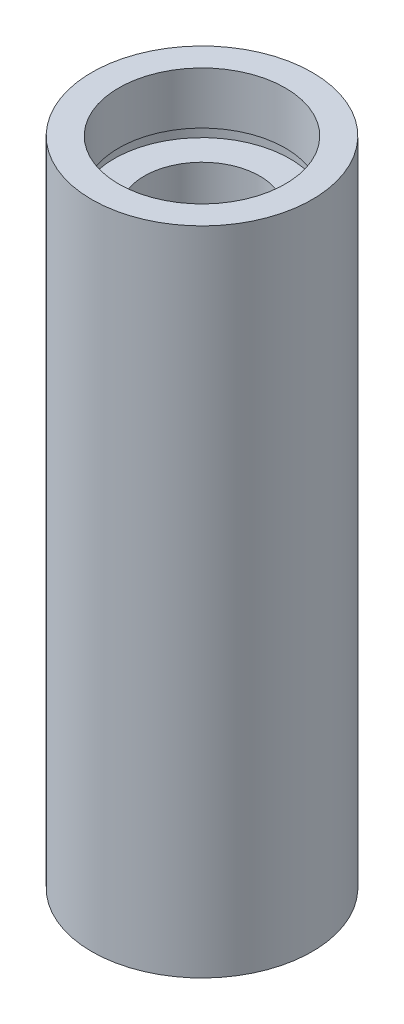
ISO-10303-21;
HEADER;
FILE_DESCRIPTION(('STEP AP214'),'2;1');
FILE_NAME('part.step','',(''),(''),'','','');
FILE_SCHEMA(('AUTOMOTIVE_DESIGN { 1 0 10303 214 1 1 1 1 }'));
ENDSEC;
DATA;
#1=APPLICATION_CONTEXT('core data for automotive mechanical design processes');
#2=APPLICATION_PROTOCOL_DEFINITION('international standard','automotive_design',2000,#1);
#3=PRODUCT_CONTEXT('',#1,'mechanical');
#4=PRODUCT('Part','Part','',(#3));
#5=PRODUCT_RELATED_PRODUCT_CATEGORY('part','',(#4));
#6=PRODUCT_DEFINITION_FORMATION('','',#4);
#7=PRODUCT_DEFINITION_CONTEXT('part definition',#1,'design');
#8=PRODUCT_DEFINITION('design','',#6,#7);
#9=PRODUCT_DEFINITION_SHAPE('','',#8);
#10=(LENGTH_UNIT() NAMED_UNIT(*) SI_UNIT(.MILLI.,.METRE.));
#11=(NAMED_UNIT(*) PLANE_ANGLE_UNIT() SI_UNIT($,.RADIAN.));
#12=(NAMED_UNIT(*) SI_UNIT($,.STERADIAN.) SOLID_ANGLE_UNIT());
#13=UNCERTAINTY_MEASURE_WITH_UNIT(LENGTH_MEASURE(1.E-05),#10,'distance_accuracy_value','');
#14=(GEOMETRIC_REPRESENTATION_CONTEXT(3) GLOBAL_UNCERTAINTY_ASSIGNED_CONTEXT((#13)) GLOBAL_UNIT_ASSIGNED_CONTEXT((#10,
#11,#12)) REPRESENTATION_CONTEXT('',''));
#15=CARTESIAN_POINT('',(0.,0.,0.));
#16=DIRECTION('',(0.,0.,1.));
#17=DIRECTION('',(1.,0.,0.));
#18=AXIS2_PLACEMENT_3D('',#15,#16,#17);
#19=CARTESIAN_POINT('',(7.00000000000002,0.,0.));
#20=DIRECTION('',(0.,1.,0.));
#21=DIRECTION('',(0.,0.,1.));
#22=AXIS2_PLACEMENT_3D('',#19,#20,#21);
#23=PLANE('',#22);
#24=CARTESIAN_POINT('',(0.,0.,0.));
#25=DIRECTION('',(0.,1.,0.));
#26=DIRECTION('',(0.,0.,1.));
#27=AXIS2_PLACEMENT_3D('',#24,#25,#26);
#28=CIRCLE('',#27,9.52500000000002);
#29=CARTESIAN_POINT('',(0.,0.,9.52500000000002));
#30=VERTEX_POINT('',#29);
#31=EDGE_CURVE('E10',#30,#30,#28,.T.);
#32=ORIENTED_EDGE('',*,*,#31,.F.);
#33=EDGE_LOOP('',(#32));
#34=FACE_BOUND('',#33,.T.);
#35=CARTESIAN_POINT('',(0.,0.,0.));
#36=DIRECTION('',(0.,1.,0.));
#37=DIRECTION('',(0.,0.,1.));
#38=AXIS2_PLACEMENT_3D('',#35,#36,#37);
#39=CIRCLE('',#38,7.00000000000002);
#40=CARTESIAN_POINT('',(0.,0.,7.00000000000002));
#41=VERTEX_POINT('',#40);
#42=EDGE_CURVE('E77',#41,#41,#39,.T.);
#43=ORIENTED_EDGE('',*,*,#42,.T.);
#44=EDGE_LOOP('',(#43));
#45=FACE_BOUND('',#44,.T.);
#46=ADVANCED_FACE('F37',(#34,#45),#23,.F.);
#47=CARTESIAN_POINT('',(0.,161.376166943427,0.));
#48=DIRECTION('',(0.,1.,0.));
#49=DIRECTION('',(0.,0.,1.));
#50=AXIS2_PLACEMENT_3D('',#47,#48,#49);
#51=CYLINDRICAL_SURFACE('',#50,9.52500000000002);
#52=CARTESIAN_POINT('',(0.,56.3,0.));
#53=DIRECTION('',(0.,1.,0.));
#54=DIRECTION('',(0.,0.,1.));
#55=AXIS2_PLACEMENT_3D('',#52,#53,#54);
#56=CIRCLE('',#55,9.52500000000002);
#57=CARTESIAN_POINT('',(0.,56.3,9.52500000000002));
#58=VERTEX_POINT('',#57);
#59=EDGE_CURVE('E43',#58,#58,#56,.T.);
#60=ORIENTED_EDGE('',*,*,#59,.F.);
#61=EDGE_LOOP('',(#60));
#62=FACE_BOUND('',#61,.T.);
#63=ORIENTED_EDGE('',*,*,#31,.T.);
#64=EDGE_LOOP('',(#63));
#65=FACE_BOUND('',#64,.T.);
#66=ADVANCED_FACE('F138',(#62,#65),#51,.T.);
#67=CARTESIAN_POINT('',(7.20000000000001,56.3,0.));
#68=DIRECTION('',(0.,-1.,0.));
#69=DIRECTION('',(0.,0.,-1.));
#70=AXIS2_PLACEMENT_3D('',#67,#68,#69);
#71=PLANE('',#70);
#72=CARTESIAN_POINT('',(0.,56.3,0.));
#73=DIRECTION('',(0.,1.,0.));
#74=DIRECTION('',(0.,0.,1.));
#75=AXIS2_PLACEMENT_3D('',#72,#73,#74);
#76=CIRCLE('',#75,7.20000000000001);
#77=CARTESIAN_POINT('',(0.,56.3,7.20000000000001));
#78=VERTEX_POINT('',#77);
#79=EDGE_CURVE('E47',#78,#78,#76,.T.);
#80=ORIENTED_EDGE('',*,*,#79,.F.);
#81=EDGE_LOOP('',(#80));
#82=FACE_BOUND('',#81,.T.);
#83=ORIENTED_EDGE('',*,*,#59,.T.);
#84=EDGE_LOOP('',(#83));
#85=FACE_BOUND('',#84,.T.);
#86=ADVANCED_FACE('F133',(#82,#85),#71,.F.);
#87=CARTESIAN_POINT('',(0.,161.376166943427,0.));
#88=DIRECTION('',(0.,1.,0.));
#89=DIRECTION('',(0.,0.,1.));
#90=AXIS2_PLACEMENT_3D('',#87,#88,#89);
#91=CYLINDRICAL_SURFACE('',#90,7.20000000000001);
#92=CARTESIAN_POINT('',(0.,51.8,0.));
#93=DIRECTION('',(0.,1.,0.));
#94=DIRECTION('',(0.,0.,1.));
#95=AXIS2_PLACEMENT_3D('',#92,#93,#94);
#96=CIRCLE('',#95,7.20000000000001);
#97=CARTESIAN_POINT('',(0.,51.8,7.20000000000001));
#98=VERTEX_POINT('',#97);
#99=EDGE_CURVE('E51',#98,#98,#96,.T.);
#100=ORIENTED_EDGE('',*,*,#99,.F.);
#101=EDGE_LOOP('',(#100));
#102=FACE_BOUND('',#101,.T.);
#103=ORIENTED_EDGE('',*,*,#79,.T.);
#104=EDGE_LOOP('',(#103));
#105=FACE_BOUND('',#104,.T.);
#106=ADVANCED_FACE('F127',(#102,#105),#91,.F.);
#107=CARTESIAN_POINT('',(7.20000000000001,51.8,0.));
#108=DIRECTION('',(0.,1.,0.));
#109=DIRECTION('',(0.,0.,1.));
#110=AXIS2_PLACEMENT_3D('',#107,#108,#109);
#111=PLANE('',#110);
#112=CARTESIAN_POINT('',(0.,51.8,0.));
#113=DIRECTION('',(0.,1.,0.));
#114=DIRECTION('',(0.,0.,1.));
#115=AXIS2_PLACEMENT_3D('',#112,#113,#114);
#116=CIRCLE('',#115,7.60000000000002);
#117=CARTESIAN_POINT('',(0.,51.8,7.60000000000002));
#118=VERTEX_POINT('',#117);
#119=EDGE_CURVE('E56',#118,#118,#116,.T.);
#120=ORIENTED_EDGE('',*,*,#119,.F.);
#121=EDGE_LOOP('',(#120));
#122=FACE_BOUND('',#121,.T.);
#123=ORIENTED_EDGE('',*,*,#99,.T.);
#124=EDGE_LOOP('',(#123));
#125=FACE_BOUND('',#124,.T.);
#126=ADVANCED_FACE('F121',(#122,#125),#111,.F.);
#127=CARTESIAN_POINT('',(0.,161.376166943427,0.));
#128=DIRECTION('',(0.,1.,0.));
#129=DIRECTION('',(0.,0.,1.));
#130=AXIS2_PLACEMENT_3D('',#127,#128,#129);
#131=CYLINDRICAL_SURFACE('',#130,7.60000000000002);
#132=CARTESIAN_POINT('',(0.,50.8,0.));
#133=DIRECTION('',(0.,1.,0.));
#134=DIRECTION('',(0.,0.,1.));
#135=AXIS2_PLACEMENT_3D('',#132,#133,#134);
#136=CIRCLE('',#135,7.60000000000002);
#137=CARTESIAN_POINT('',(0.,50.8,7.60000000000002));
#138=VERTEX_POINT('',#137);
#139=EDGE_CURVE('E59',#138,#138,#136,.T.);
#140=ORIENTED_EDGE('',*,*,#139,.F.);
#141=EDGE_LOOP('',(#140));
#142=FACE_BOUND('',#141,.T.);
#143=ORIENTED_EDGE('',*,*,#119,.T.);
#144=EDGE_LOOP('',(#143));
#145=FACE_BOUND('',#144,.T.);
#146=ADVANCED_FACE('F115',(#142,#145),#131,.F.);
#147=CARTESIAN_POINT('',(5.00000000000002,50.8,0.));
#148=DIRECTION('',(0.,-1.,0.));
#149=DIRECTION('',(0.,0.,-1.));
#150=AXIS2_PLACEMENT_3D('',#147,#148,#149);
#151=PLANE('',#150);
#152=CARTESIAN_POINT('',(0.,50.8,0.));
#153=DIRECTION('',(0.,1.,0.));
#154=DIRECTION('',(0.,0.,1.));
#155=AXIS2_PLACEMENT_3D('',#152,#153,#154);
#156=CIRCLE('',#155,5.00000000000002);
#157=CARTESIAN_POINT('',(0.,50.8,5.00000000000002));
#158=VERTEX_POINT('',#157);
#159=EDGE_CURVE('E62',#158,#158,#156,.T.);
#160=ORIENTED_EDGE('',*,*,#159,.F.);
#161=EDGE_LOOP('',(#160));
#162=FACE_BOUND('',#161,.T.);
#163=ORIENTED_EDGE('',*,*,#139,.T.);
#164=EDGE_LOOP('',(#163));
#165=FACE_BOUND('',#164,.T.);
#166=ADVANCED_FACE('F109',(#162,#165),#151,.F.);
#167=CARTESIAN_POINT('',(0.,161.376166943427,0.));
#168=DIRECTION('',(0.,1.,0.));
#169=DIRECTION('',(0.,0.,1.));
#170=AXIS2_PLACEMENT_3D('',#167,#168,#169);
#171=CYLINDRICAL_SURFACE('',#170,5.00000000000002);
#172=CARTESIAN_POINT('',(0.,5.49999999999998,0.));
#173=DIRECTION('',(0.,1.,0.));
#174=DIRECTION('',(0.,0.,1.));
#175=AXIS2_PLACEMENT_3D('',#172,#173,#174);
#176=CIRCLE('',#175,5.00000000000002);
#177=CARTESIAN_POINT('',(0.,5.49999999999998,5.00000000000002));
#178=VERTEX_POINT('',#177);
#179=EDGE_CURVE('E65',#178,#178,#176,.T.);
#180=ORIENTED_EDGE('',*,*,#179,.F.);
#181=EDGE_LOOP('',(#180));
#182=FACE_BOUND('',#181,.T.);
#183=ORIENTED_EDGE('',*,*,#159,.T.);
#184=EDGE_LOOP('',(#183));
#185=FACE_BOUND('',#184,.T.);
#186=ADVANCED_FACE('F103',(#182,#185),#171,.F.);
#187=CARTESIAN_POINT('',(5.00000000000002,5.49999999999998,0.));
#188=DIRECTION('',(0.,1.,0.));
#189=DIRECTION('',(0.,0.,1.));
#190=AXIS2_PLACEMENT_3D('',#187,#188,#189);
#191=PLANE('',#190);
#192=CARTESIAN_POINT('',(0.,5.49999999999998,0.));
#193=DIRECTION('',(0.,1.,0.));
#194=DIRECTION('',(0.,0.,1.));
#195=AXIS2_PLACEMENT_3D('',#192,#193,#194);
#196=CIRCLE('',#195,7.60000000000002);
#197=CARTESIAN_POINT('',(0.,5.49999999999998,7.60000000000002));
#198=VERTEX_POINT('',#197);
#199=EDGE_CURVE('E68',#198,#198,#196,.T.);
#200=ORIENTED_EDGE('',*,*,#199,.F.);
#201=EDGE_LOOP('',(#200));
#202=FACE_BOUND('',#201,.T.);
#203=ORIENTED_EDGE('',*,*,#179,.T.);
#204=EDGE_LOOP('',(#203));
#205=FACE_BOUND('',#204,.T.);
#206=ADVANCED_FACE('F97',(#202,#205),#191,.F.);
#207=CARTESIAN_POINT('',(0.,161.376166943427,0.));
#208=DIRECTION('',(0.,1.,0.));
#209=DIRECTION('',(0.,0.,1.));
#210=AXIS2_PLACEMENT_3D('',#207,#208,#209);
#211=CYLINDRICAL_SURFACE('',#210,7.60000000000002);
#212=CARTESIAN_POINT('',(0.,4.49999999999998,0.));
#213=DIRECTION('',(0.,1.,0.));
#214=DIRECTION('',(0.,0.,1.));
#215=AXIS2_PLACEMENT_3D('',#212,#213,#214);
#216=CIRCLE('',#215,7.60000000000002);
#217=CARTESIAN_POINT('',(0.,4.49999999999998,7.60000000000002));
#218=VERTEX_POINT('',#217);
#219=EDGE_CURVE('E71',#218,#218,#216,.T.);
#220=ORIENTED_EDGE('',*,*,#219,.F.);
#221=EDGE_LOOP('',(#220));
#222=FACE_BOUND('',#221,.T.);
#223=ORIENTED_EDGE('',*,*,#199,.T.);
#224=EDGE_LOOP('',(#223));
#225=FACE_BOUND('',#224,.T.);
#226=ADVANCED_FACE('F91',(#222,#225),#211,.F.);
#227=CARTESIAN_POINT('',(7.00000000000002,4.49999999999998,0.));
#228=DIRECTION('',(0.,-1.,0.));
#229=DIRECTION('',(0.,0.,-1.));
#230=AXIS2_PLACEMENT_3D('',#227,#228,#229);
#231=PLANE('',#230);
#232=CARTESIAN_POINT('',(0.,4.49999999999998,0.));
#233=DIRECTION('',(0.,1.,0.));
#234=DIRECTION('',(0.,0.,1.));
#235=AXIS2_PLACEMENT_3D('',#232,#233,#234);
#236=CIRCLE('',#235,7.00000000000002);
#237=CARTESIAN_POINT('',(0.,4.49999999999998,7.00000000000002));
#238=VERTEX_POINT('',#237);
#239=EDGE_CURVE('E74',#238,#238,#236,.T.);
#240=ORIENTED_EDGE('',*,*,#239,.F.);
#241=EDGE_LOOP('',(#240));
#242=FACE_BOUND('',#241,.T.);
#243=ORIENTED_EDGE('',*,*,#219,.T.);
#244=EDGE_LOOP('',(#243));
#245=FACE_BOUND('',#244,.T.);
#246=ADVANCED_FACE('F85',(#242,#245),#231,.F.);
#247=CARTESIAN_POINT('',(0.,161.376166943427,0.));
#248=DIRECTION('',(0.,1.,0.));
#249=DIRECTION('',(0.,0.,1.));
#250=AXIS2_PLACEMENT_3D('',#247,#248,#249);
#251=CYLINDRICAL_SURFACE('',#250,7.00000000000002);
#252=ORIENTED_EDGE('',*,*,#42,.F.);
#253=EDGE_LOOP('',(#252));
#254=FACE_BOUND('',#253,.T.);
#255=ORIENTED_EDGE('',*,*,#239,.T.);
#256=EDGE_LOOP('',(#255));
#257=FACE_BOUND('',#256,.T.);
#258=ADVANCED_FACE('F82',(#254,#257),#251,.F.);
#259=CLOSED_SHELL('',(#46,#66,#86,#106,#126,#146,#166,#186,#206,#226,#246,#258));
#260=MANIFOLD_SOLID_BREP('B2',#259);
#261=ADVANCED_BREP_SHAPE_REPRESENTATION('',(#18,#260),#14);
#262=SHAPE_DEFINITION_REPRESENTATION(#9,#261);
ENDSEC;
END-ISO-10303-21;
